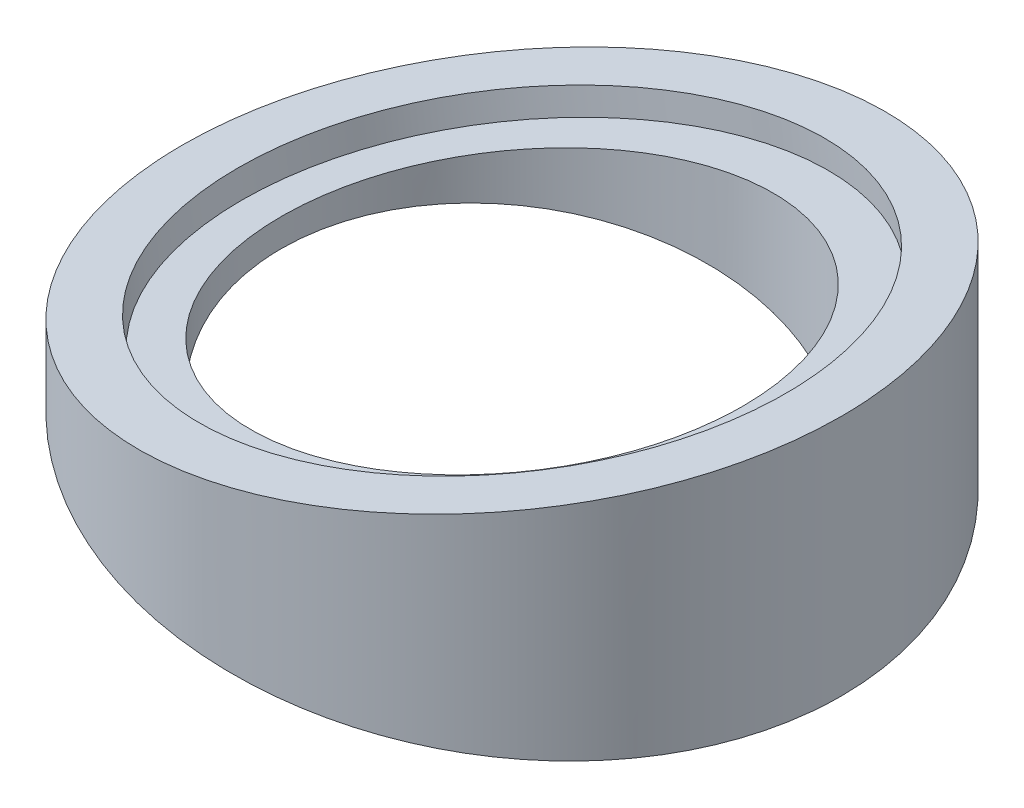
ISO-10303-21;
HEADER;
FILE_DESCRIPTION(('STEP AP214'),'2;1');
FILE_NAME('part.step','',(''),(''),'','','');
FILE_SCHEMA(('AUTOMOTIVE_DESIGN { 1 0 10303 214 1 1 1 1 }'));
ENDSEC;
DATA;
#1=APPLICATION_CONTEXT('core data for automotive mechanical design processes');
#2=APPLICATION_PROTOCOL_DEFINITION('international standard','automotive_design',2000,#1);
#3=PRODUCT_CONTEXT('',#1,'mechanical');
#4=PRODUCT('Part','Part','',(#3));
#5=PRODUCT_RELATED_PRODUCT_CATEGORY('part','',(#4));
#6=PRODUCT_DEFINITION_FORMATION('','',#4);
#7=PRODUCT_DEFINITION_CONTEXT('part definition',#1,'design');
#8=PRODUCT_DEFINITION('design','',#6,#7);
#9=PRODUCT_DEFINITION_SHAPE('','',#8);
#10=(LENGTH_UNIT() NAMED_UNIT(*) SI_UNIT(.MILLI.,.METRE.));
#11=(NAMED_UNIT(*) PLANE_ANGLE_UNIT() SI_UNIT($,.RADIAN.));
#12=(NAMED_UNIT(*) SI_UNIT($,.STERADIAN.) SOLID_ANGLE_UNIT());
#13=UNCERTAINTY_MEASURE_WITH_UNIT(LENGTH_MEASURE(1.E-05),#10,'distance_accuracy_value','');
#14=(GEOMETRIC_REPRESENTATION_CONTEXT(3) GLOBAL_UNCERTAINTY_ASSIGNED_CONTEXT((#13)) GLOBAL_UNIT_ASSIGNED_CONTEXT((#10,
#11,#12)) REPRESENTATION_CONTEXT('',''));
#15=CARTESIAN_POINT('',(0.,0.,0.));
#16=DIRECTION('',(0.,0.,1.));
#17=DIRECTION('',(1.,0.,0.));
#18=AXIS2_PLACEMENT_3D('',#15,#16,#17);
#19=CARTESIAN_POINT('',(0.,-32.,0.));
#20=DIRECTION('',(0.,1.,0.));
#21=DIRECTION('',(0.,0.,1.));
#22=AXIS2_PLACEMENT_3D('',#19,#20,#21);
#23=CYLINDRICAL_SURFACE('',#22,17.5);
#24=CARTESIAN_POINT('',(0.,23.5738828916742,0.));
#25=DIRECTION('',(-0.142314524170676,0.989821487042019,0.));
#26=DIRECTION('',(0.989821487042019,0.142314524170676,0.));
#27=AXIS2_PLACEMENT_3D('',#24,#25,#26);
#28=ELLIPSE('',#27,17.679955657759,17.5);
#29=CARTESIAN_POINT('',(17.5,26.0899973684668,0.));
#30=VERTEX_POINT('',#29);
#31=EDGE_CURVE('E52',#30,#30,#28,.F.);
#32=ORIENTED_EDGE('',*,*,#31,.F.);
#33=EDGE_LOOP('',(#32));
#34=FACE_BOUND('',#33,.T.);
#35=CARTESIAN_POINT('',(0.,16.4261171083259,0.));
#36=DIRECTION('',(-0.142314524170676,-0.989821487042019,0.));
#37=DIRECTION('',(-0.989821487042019,0.142314524170676,0.));
#38=AXIS2_PLACEMENT_3D('',#35,#36,#37);
#39=ELLIPSE('',#38,17.679955657759,17.5);
#40=CARTESIAN_POINT('',(-17.5,18.9422315851185,0.));
#41=VERTEX_POINT('',#40);
#42=EDGE_CURVE('E41',#41,#41,#39,.F.);
#43=ORIENTED_EDGE('',*,*,#42,.F.);
#44=EDGE_LOOP('',(#43));
#45=FACE_BOUND('',#44,.T.);
#46=ADVANCED_FACE('F37',(#34,#45),#23,.F.);
#47=CARTESIAN_POINT('',(-25.,18.,-38.5));
#48=DIRECTION('',(0.142314524170676,0.989821487042019,0.));
#49=DIRECTION('',(-0.989821487042019,0.142314524170676,0.));
#50=AXIS2_PLACEMENT_3D('',#47,#48,#49);
#51=PLANE('',#50);
#52=CARTESIAN_POINT('',(0.,14.4055507474391,0.));
#53=DIRECTION('',(-0.142314524170676,-0.989821487042019,0.));
#54=DIRECTION('',(0.989821487042019,-0.142314524170676,0.));
#55=AXIS2_PLACEMENT_3D('',#52,#53,#54);
#56=CIRCLE('',#55,21.);
#57=CARTESIAN_POINT('',(20.7862512278824,11.4169457398549,0.));
#58=VERTEX_POINT('',#57);
#59=EDGE_CURVE('E69',#58,#58,#56,.T.);
#60=ORIENTED_EDGE('',*,*,#59,.F.);
#61=EDGE_LOOP('',(#60));
#62=FACE_BOUND('',#61,.T.);
#63=CARTESIAN_POINT('',(0.,14.4055507474391,0.));
#64=DIRECTION('',(0.142314524170676,0.989821487042019,0.));
#65=DIRECTION('',(0.989821487042019,-0.142314524170676,0.));
#66=AXIS2_PLACEMENT_3D('',#63,#64,#65);
#67=ELLIPSE('',#66,25.2570795110843,25.);
#68=CARTESIAN_POINT('',(25.,10.8111014948782,0.));
#69=VERTEX_POINT('',#68);
#70=EDGE_CURVE('E46',#69,#69,#67,.T.);
#71=ORIENTED_EDGE('',*,*,#70,.F.);
#72=EDGE_LOOP('',(#71));
#73=FACE_BOUND('',#72,.T.);
#74=ADVANCED_FACE('F85',(#62,#73),#51,.F.);
#75=CARTESIAN_POINT('',(-25.,22.,-38.5));
#76=DIRECTION('',(0.142314524170676,-0.989821487042019,0.));
#77=DIRECTION('',(0.989821487042019,0.142314524170676,0.));
#78=AXIS2_PLACEMENT_3D('',#75,#76,#77);
#79=PLANE('',#78);
#80=CARTESIAN_POINT('',(0.,25.5944492525609,0.));
#81=DIRECTION('',(-0.142314524170676,0.989821487042019,0.));
#82=DIRECTION('',(-0.989821487042019,-0.142314524170676,0.));
#83=AXIS2_PLACEMENT_3D('',#80,#81,#82);
#84=CIRCLE('',#83,21.);
#85=CARTESIAN_POINT('',(-20.7862512278824,22.6058442449767,0.));
#86=VERTEX_POINT('',#85);
#87=EDGE_CURVE('E62',#86,#86,#84,.T.);
#88=ORIENTED_EDGE('',*,*,#87,.F.);
#89=EDGE_LOOP('',(#88));
#90=FACE_BOUND('',#89,.T.);
#91=CARTESIAN_POINT('',(0.,25.5944492525609,0.));
#92=DIRECTION('',(0.142314524170676,-0.989821487042019,0.));
#93=DIRECTION('',(-0.989821487042019,-0.142314524170676,0.));
#94=AXIS2_PLACEMENT_3D('',#91,#92,#93);
#95=ELLIPSE('',#94,25.2570795110843,25.);
#96=CARTESIAN_POINT('',(-25.,22.,0.));
#97=VERTEX_POINT('',#96);
#98=EDGE_CURVE('E10',#97,#97,#95,.T.);
#99=ORIENTED_EDGE('',*,*,#98,.F.);
#100=EDGE_LOOP('',(#99));
#101=FACE_BOUND('',#100,.T.);
#102=ADVANCED_FACE('F90',(#90,#101),#79,.F.);
#103=CARTESIAN_POINT('',(0.,40.,0.));
#104=DIRECTION('',(0.,-1.,0.));
#105=DIRECTION('',(0.,0.,-1.));
#106=AXIS2_PLACEMENT_3D('',#103,#104,#105);
#107=CYLINDRICAL_SURFACE('',#106,25.);
#108=ORIENTED_EDGE('',*,*,#98,.T.);
#109=EDGE_LOOP('',(#108));
#110=FACE_BOUND('',#109,.T.);
#111=ORIENTED_EDGE('',*,*,#70,.T.);
#112=EDGE_LOOP('',(#111));
#113=FACE_BOUND('',#112,.T.);
#114=ADVANCED_FACE('F39',(#110,#113),#107,.T.);
#115=CARTESIAN_POINT('',(0.284629048341351,23.6148062784769,0.));
#116=DIRECTION('',(-0.142314524170676,0.989821487042019,0.));
#117=DIRECTION('',(-0.989821487042019,-0.142314524170676,0.));
#118=AXIS2_PLACEMENT_3D('',#115,#116,#117);
#119=PLANE('',#118);
#120=CARTESIAN_POINT('',(0.284629048341351,23.6148062784769,0.));
#121=DIRECTION('',(-0.142314524170676,0.989821487042019,0.));
#122=DIRECTION('',(-0.989821487042019,-0.142314524170676,0.));
#123=AXIS2_PLACEMENT_3D('',#120,#121,#122);
#124=CIRCLE('',#123,21.);
#125=CARTESIAN_POINT('',(-20.5016221795411,20.6262012708927,0.));
#126=VERTEX_POINT('',#125);
#127=EDGE_CURVE('E57',#126,#126,#124,.T.);
#128=ORIENTED_EDGE('',*,*,#127,.T.);
#129=EDGE_LOOP('',(#128));
#130=FACE_BOUND('',#129,.T.);
#131=ORIENTED_EDGE('',*,*,#31,.T.);
#132=EDGE_LOOP('',(#131));
#133=FACE_BOUND('',#132,.T.);
#134=ADVANCED_FACE('F100',(#130,#133),#119,.T.);
#135=CARTESIAN_POINT('',(0.284629048341351,23.6148062784769,0.));
#136=DIRECTION('',(-0.142314524170676,0.989821487042019,0.));
#137=DIRECTION('',(-0.989821487042019,-0.142314524170676,0.));
#138=AXIS2_PLACEMENT_3D('',#135,#136,#137);
#139=CYLINDRICAL_SURFACE('',#138,21.);
#140=ORIENTED_EDGE('',*,*,#127,.F.);
#141=EDGE_LOOP('',(#140));
#142=FACE_BOUND('',#141,.T.);
#143=ORIENTED_EDGE('',*,*,#87,.T.);
#144=EDGE_LOOP('',(#143));
#145=FACE_BOUND('',#144,.T.);
#146=ADVANCED_FACE('F97',(#142,#145),#139,.F.);
#147=CARTESIAN_POINT('',(0.284629048341353,16.3851937215232,0.));
#148=DIRECTION('',(-0.142314524170676,-0.989821487042019,0.));
#149=DIRECTION('',(0.989821487042019,-0.142314524170676,0.));
#150=AXIS2_PLACEMENT_3D('',#147,#148,#149);
#151=PLANE('',#150);
#152=CARTESIAN_POINT('',(0.284629048341353,16.3851937215232,0.));
#153=DIRECTION('',(-0.142314524170676,-0.989821487042019,0.));
#154=DIRECTION('',(0.989821487042019,-0.142314524170676,0.));
#155=AXIS2_PLACEMENT_3D('',#152,#153,#154);
#156=CIRCLE('',#155,21.);
#157=CARTESIAN_POINT('',(21.0708802762238,13.396588713939,0.));
#158=VERTEX_POINT('',#157);
#159=EDGE_CURVE('E73',#158,#158,#156,.T.);
#160=ORIENTED_EDGE('',*,*,#159,.T.);
#161=EDGE_LOOP('',(#160));
#162=FACE_BOUND('',#161,.T.);
#163=ORIENTED_EDGE('',*,*,#42,.T.);
#164=EDGE_LOOP('',(#163));
#165=FACE_BOUND('',#164,.T.);
#166=ADVANCED_FACE('F82',(#162,#165),#151,.T.);
#167=CARTESIAN_POINT('',(0.284629048341353,16.3851937215232,0.));
#168=DIRECTION('',(-0.142314524170676,-0.989821487042019,0.));
#169=DIRECTION('',(0.989821487042019,-0.142314524170676,0.));
#170=AXIS2_PLACEMENT_3D('',#167,#168,#169);
#171=CYLINDRICAL_SURFACE('',#170,21.);
#172=ORIENTED_EDGE('',*,*,#159,.F.);
#173=EDGE_LOOP('',(#172));
#174=FACE_BOUND('',#173,.T.);
#175=ORIENTED_EDGE('',*,*,#59,.T.);
#176=EDGE_LOOP('',(#175));
#177=FACE_BOUND('',#176,.T.);
#178=ADVANCED_FACE('F104',(#174,#177),#171,.F.);
#179=CLOSED_SHELL('',(#46,#74,#102,#114,#134,#146,#166,#178));
#180=MANIFOLD_SOLID_BREP('B2',#179);
#181=ADVANCED_BREP_SHAPE_REPRESENTATION('',(#18,#180),#14);
#182=SHAPE_DEFINITION_REPRESENTATION(#9,#181);
ENDSEC;
END-ISO-10303-21;
